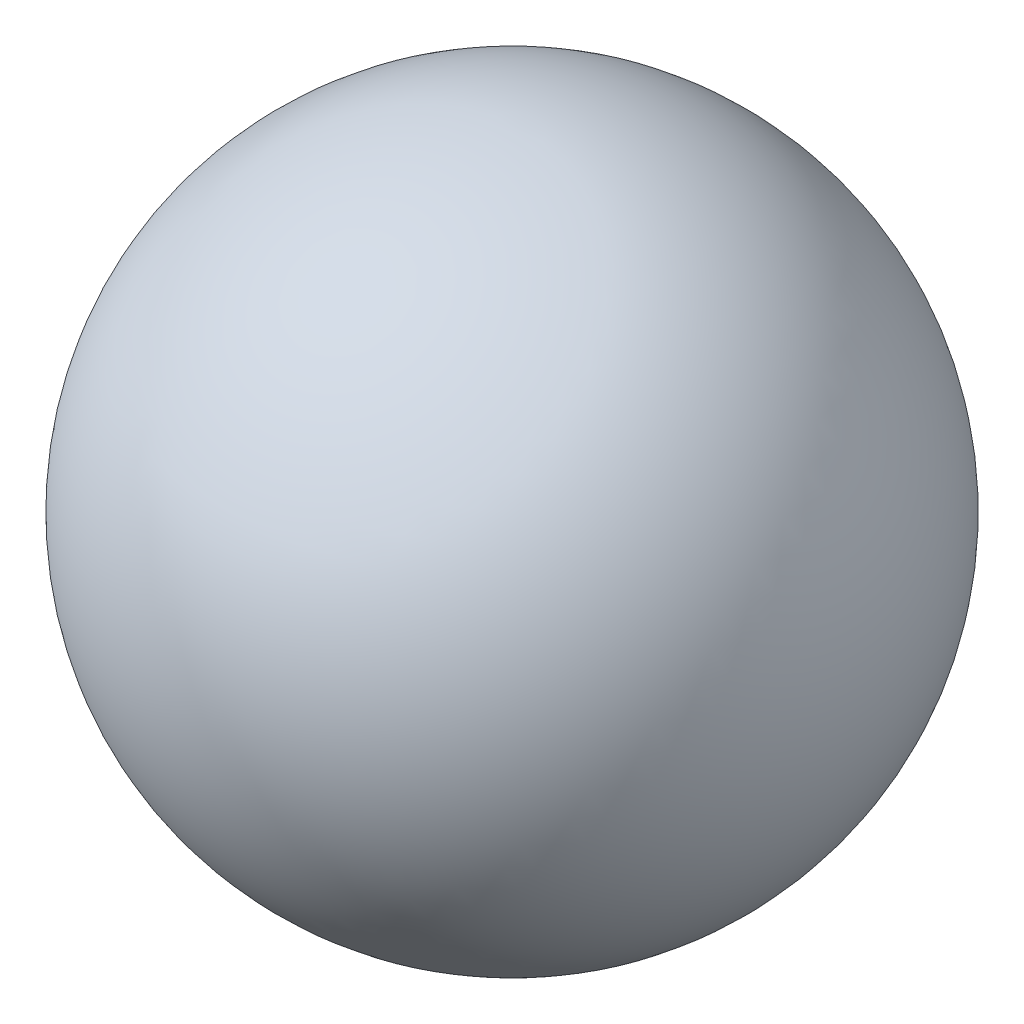
ISO-10303-21;
HEADER;
FILE_DESCRIPTION(('STEP AP214'),'2;1');
FILE_NAME('part.step','',(''),(''),'','','');
FILE_SCHEMA(('AUTOMOTIVE_DESIGN { 1 0 10303 214 1 1 1 1 }'));
ENDSEC;
DATA;
#1=APPLICATION_CONTEXT('core data for automotive mechanical design processes');
#2=APPLICATION_PROTOCOL_DEFINITION('international standard','automotive_design',2000,#1);
#3=PRODUCT_CONTEXT('',#1,'mechanical');
#4=PRODUCT('Part','Part','',(#3));
#5=PRODUCT_RELATED_PRODUCT_CATEGORY('part','',(#4));
#6=PRODUCT_DEFINITION_FORMATION('','',#4);
#7=PRODUCT_DEFINITION_CONTEXT('part definition',#1,'design');
#8=PRODUCT_DEFINITION('design','',#6,#7);
#9=PRODUCT_DEFINITION_SHAPE('','',#8);
#10=(LENGTH_UNIT() NAMED_UNIT(*) SI_UNIT(.MILLI.,.METRE.));
#11=(NAMED_UNIT(*) PLANE_ANGLE_UNIT() SI_UNIT($,.RADIAN.));
#12=(NAMED_UNIT(*) SI_UNIT($,.STERADIAN.) SOLID_ANGLE_UNIT());
#13=UNCERTAINTY_MEASURE_WITH_UNIT(LENGTH_MEASURE(1.E-05),#10,'distance_accuracy_value','');
#14=(GEOMETRIC_REPRESENTATION_CONTEXT(3) GLOBAL_UNCERTAINTY_ASSIGNED_CONTEXT((#13)) GLOBAL_UNIT_ASSIGNED_CONTEXT((#10,
#11,#12)) REPRESENTATION_CONTEXT('',''));
#15=CARTESIAN_POINT('',(0.,0.,0.));
#16=DIRECTION('',(0.,0.,1.));
#17=DIRECTION('',(1.,0.,0.));
#18=AXIS2_PLACEMENT_3D('',#15,#16,#17);
#19=CARTESIAN_POINT('',(0.,0.,0.));
#20=DIRECTION('',(0.,1.,0.));
#21=DIRECTION('',(1.,0.,0.));
#22=AXIS2_PLACEMENT_3D('',#19,#20,#21);
#23=SPHERICAL_SURFACE('',#22,21.25);
#24=CARTESIAN_POINT('',(0.,21.25,0.));
#25=VERTEX_POINT('',#24);
#26=VERTEX_LOOP('',#25);
#27=FACE_BOUND('',#26,.T.);
#28=ADVANCED_FACE('F30',(#27),#23,.T.);
#29=CLOSED_SHELL('',(#28));
#30=MANIFOLD_SOLID_BREP('B2',#29);
#31=ADVANCED_BREP_SHAPE_REPRESENTATION('',(#18,#30),#14);
#32=SHAPE_DEFINITION_REPRESENTATION(#9,#31);
ENDSEC;
END-ISO-10303-21;
